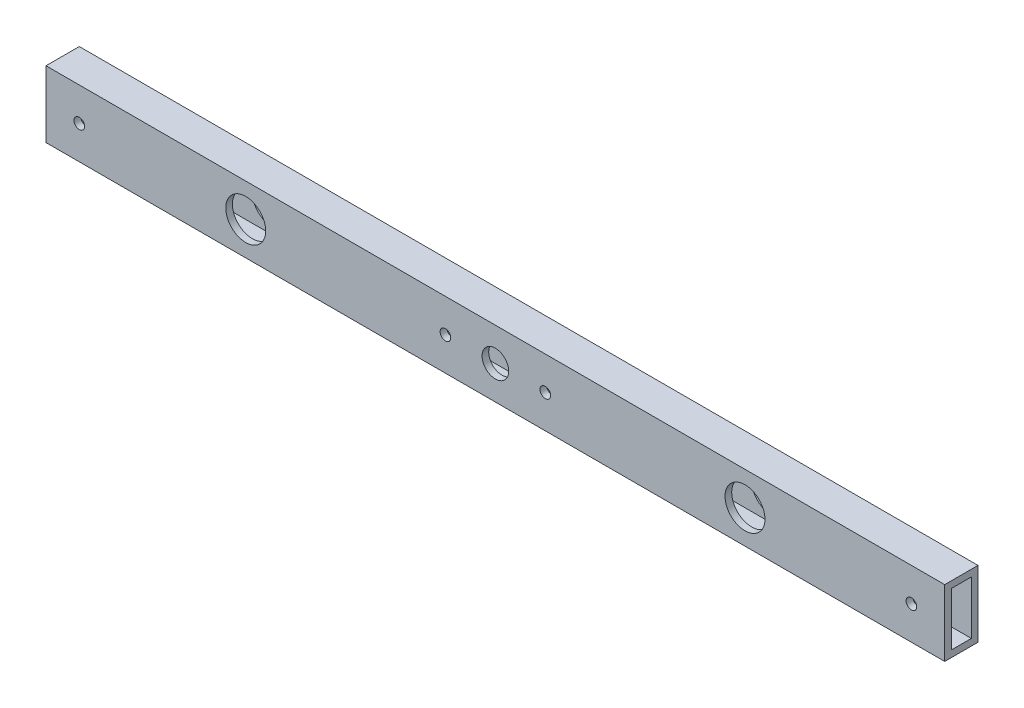
ISO-10303-21;
HEADER;
FILE_DESCRIPTION(('STEP AP214'),'2;1');
FILE_NAME('part.step','',(''),(''),'','','');
FILE_SCHEMA(('AUTOMOTIVE_DESIGN { 1 0 10303 214 1 1 1 1 }'));
ENDSEC;
DATA;
#1=APPLICATION_CONTEXT('core data for automotive mechanical design processes');
#2=APPLICATION_PROTOCOL_DEFINITION('international standard','automotive_design',2000,#1);
#3=PRODUCT_CONTEXT('',#1,'mechanical');
#4=PRODUCT('Part','Part','',(#3));
#5=PRODUCT_RELATED_PRODUCT_CATEGORY('part','',(#4));
#6=PRODUCT_DEFINITION_FORMATION('','',#4);
#7=PRODUCT_DEFINITION_CONTEXT('part definition',#1,'design');
#8=PRODUCT_DEFINITION('design','',#6,#7);
#9=PRODUCT_DEFINITION_SHAPE('','',#8);
#10=(LENGTH_UNIT() NAMED_UNIT(*) SI_UNIT(.MILLI.,.METRE.));
#11=(NAMED_UNIT(*) PLANE_ANGLE_UNIT() SI_UNIT($,.RADIAN.));
#12=(NAMED_UNIT(*) SI_UNIT($,.STERADIAN.) SOLID_ANGLE_UNIT());
#13=UNCERTAINTY_MEASURE_WITH_UNIT(LENGTH_MEASURE(1.E-05),#10,'distance_accuracy_value','');
#14=(GEOMETRIC_REPRESENTATION_CONTEXT(3) GLOBAL_UNCERTAINTY_ASSIGNED_CONTEXT((#13)) GLOBAL_UNIT_ASSIGNED_CONTEXT((#10,
#11,#12)) REPRESENTATION_CONTEXT('',''));
#15=CARTESIAN_POINT('',(0.,0.,0.));
#16=DIRECTION('',(0.,0.,1.));
#17=DIRECTION('',(1.,0.,0.));
#18=AXIS2_PLACEMENT_3D('',#15,#16,#17);
#19=CARTESIAN_POINT('',(270.,-8.,3.));
#20=DIRECTION('',(0.,0.,-1.));
#21=DIRECTION('',(-1.,0.,0.));
#22=AXIS2_PLACEMENT_3D('',#19,#20,#21);
#23=PLANE('',#22);
#24=CARTESIAN_POINT('',(120.,0.,3.));
#25=DIRECTION('',(0.,0.,-1.));
#26=DIRECTION('',(-1.,0.,0.));
#27=AXIS2_PLACEMENT_3D('',#24,#25,#26);
#28=CIRCLE('',#27,1.60000000000001);
#29=CARTESIAN_POINT('',(118.4,0.,3.));
#30=VERTEX_POINT('',#29);
#31=EDGE_CURVE('E263',#30,#30,#28,.T.);
#32=ORIENTED_EDGE('',*,*,#31,.F.);
#33=EDGE_LOOP('',(#32));
#34=FACE_BOUND('',#33,.T.);
#35=CARTESIAN_POINT('',(150.,0.,3.));
#36=DIRECTION('',(0.,0.,-1.));
#37=DIRECTION('',(-1.,0.,0.));
#38=AXIS2_PLACEMENT_3D('',#35,#36,#37);
#39=CIRCLE('',#38,1.59999999999999);
#40=CARTESIAN_POINT('',(148.4,0.,3.));
#41=VERTEX_POINT('',#40);
#42=EDGE_CURVE('E269',#41,#41,#39,.T.);
#43=ORIENTED_EDGE('',*,*,#42,.F.);
#44=EDGE_LOOP('',(#43));
#45=FACE_BOUND('',#44,.T.);
#46=CARTESIAN_POINT('',(135.,0.,3.));
#47=DIRECTION('',(0.,0.,-1.));
#48=DIRECTION('',(-1.,0.,0.));
#49=AXIS2_PLACEMENT_3D('',#46,#47,#48);
#50=CIRCLE('',#49,3.99999999999999);
#51=CARTESIAN_POINT('',(131.,0.,3.));
#52=VERTEX_POINT('',#51);
#53=EDGE_CURVE('E244',#52,#52,#50,.T.);
#54=ORIENTED_EDGE('',*,*,#53,.F.);
#55=EDGE_LOOP('',(#54));
#56=FACE_BOUND('',#55,.T.);
#57=CARTESIAN_POINT('',(60.,0.,3.));
#58=DIRECTION('',(0.,0.,-1.));
#59=DIRECTION('',(-1.,0.,0.));
#60=AXIS2_PLACEMENT_3D('',#57,#58,#59);
#61=CIRCLE('',#60,6.);
#62=CARTESIAN_POINT('',(54.,0.,3.));
#63=VERTEX_POINT('',#62);
#64=EDGE_CURVE('E220',#63,#63,#61,.T.);
#65=ORIENTED_EDGE('',*,*,#64,.F.);
#66=EDGE_LOOP('',(#65));
#67=FACE_BOUND('',#66,.T.);
#68=CARTESIAN_POINT('',(210.,0.,3.));
#69=DIRECTION('',(0.,0.,-1.));
#70=DIRECTION('',(-1.,0.,0.));
#71=AXIS2_PLACEMENT_3D('',#68,#69,#70);
#72=CIRCLE('',#71,6.00000000000002);
#73=CARTESIAN_POINT('',(204.,0.,3.));
#74=VERTEX_POINT('',#73);
#75=EDGE_CURVE('E233',#74,#74,#72,.T.);
#76=ORIENTED_EDGE('',*,*,#75,.F.);
#77=EDGE_LOOP('',(#76));
#78=FACE_BOUND('',#77,.T.);
#79=CARTESIAN_POINT('',(10.,0.,3.));
#80=DIRECTION('',(0.,0.,-1.));
#81=DIRECTION('',(-1.,0.,0.));
#82=AXIS2_PLACEMENT_3D('',#79,#80,#81);
#83=CIRCLE('',#82,1.6);
#84=CARTESIAN_POINT('',(8.40000000000001,0.,3.));
#85=VERTEX_POINT('',#84);
#86=EDGE_CURVE('E155',#85,#85,#83,.T.);
#87=ORIENTED_EDGE('',*,*,#86,.F.);
#88=EDGE_LOOP('',(#87));
#89=FACE_BOUND('',#88,.T.);
#90=CARTESIAN_POINT('',(260.,0.,3.));
#91=DIRECTION('',(0.,0.,-1.));
#92=DIRECTION('',(-1.,0.,0.));
#93=AXIS2_PLACEMENT_3D('',#90,#91,#92);
#94=CIRCLE('',#93,1.59999999999996);
#95=CARTESIAN_POINT('',(258.4,0.,3.));
#96=VERTEX_POINT('',#95);
#97=EDGE_CURVE('E209',#96,#96,#94,.T.);
#98=ORIENTED_EDGE('',*,*,#97,.F.);
#99=EDGE_LOOP('',(#98));
#100=FACE_BOUND('',#99,.T.);
#101=DIRECTION('',(0.,-1.,0.));
#102=VECTOR('',#101,1.);
#103=CARTESIAN_POINT('',(0.,-8.,3.));
#104=LINE('',#103,#102);
#105=CARTESIAN_POINT('',(0.,8.,3.));
#106=VERTEX_POINT('',#105);
#107=CARTESIAN_POINT('',(0.,-8.,3.));
#108=VERTEX_POINT('',#107);
#109=EDGE_CURVE('E161',#106,#108,#104,.T.);
#110=ORIENTED_EDGE('',*,*,#109,.F.);
#111=DIRECTION('',(-1.,0.,0.));
#112=VECTOR('',#111,1.);
#113=CARTESIAN_POINT('',(270.,8.,3.));
#114=LINE('',#113,#112);
#115=CARTESIAN_POINT('',(270.,8.,3.));
#116=VERTEX_POINT('',#115);
#117=EDGE_CURVE('E12',#116,#106,#114,.T.);
#118=ORIENTED_EDGE('',*,*,#117,.F.);
#119=DIRECTION('',(0.,-1.,0.));
#120=VECTOR('',#119,1.);
#121=CARTESIAN_POINT('',(270.,-8.,3.));
#122=LINE('',#121,#120);
#123=CARTESIAN_POINT('',(270.,-8.,3.));
#124=VERTEX_POINT('',#123);
#125=EDGE_CURVE('E142',#116,#124,#122,.T.);
#126=ORIENTED_EDGE('',*,*,#125,.T.);
#127=DIRECTION('',(-1.,0.,0.));
#128=VECTOR('',#127,1.);
#129=CARTESIAN_POINT('',(270.,-8.,3.));
#130=LINE('',#129,#128);
#131=EDGE_CURVE('E73',#124,#108,#130,.T.);
#132=ORIENTED_EDGE('',*,*,#131,.T.);
#133=EDGE_LOOP('',(#110,#118,#126,#132));
#134=FACE_BOUND('',#133,.T.);
#135=ADVANCED_FACE('F54',(#34,#45,#56,#67,#78,#89,#100,#134),#23,.T.);
#136=CARTESIAN_POINT('',(270.,8.,3.));
#137=DIRECTION('',(0.,-1.,0.));
#138=DIRECTION('',(0.,0.,-1.));
#139=AXIS2_PLACEMENT_3D('',#136,#137,#138);
#140=PLANE('',#139);
#141=DIRECTION('',(0.,0.,1.));
#142=VECTOR('',#141,1.);
#143=CARTESIAN_POINT('',(0.,8.,3.));
#144=LINE('',#143,#142);
#145=CARTESIAN_POINT('',(0.,8.,-3.));
#146=VERTEX_POINT('',#145);
#147=EDGE_CURVE('E131',#146,#106,#144,.T.);
#148=ORIENTED_EDGE('',*,*,#147,.F.);
#149=DIRECTION('',(-1.,0.,0.));
#150=VECTOR('',#149,1.);
#151=CARTESIAN_POINT('',(270.,8.,-3.));
#152=LINE('',#151,#150);
#153=CARTESIAN_POINT('',(270.,8.,-3.));
#154=VERTEX_POINT('',#153);
#155=EDGE_CURVE('E64',#154,#146,#152,.T.);
#156=ORIENTED_EDGE('',*,*,#155,.F.);
#157=DIRECTION('',(0.,0.,1.));
#158=VECTOR('',#157,1.);
#159=CARTESIAN_POINT('',(270.,8.,3.));
#160=LINE('',#159,#158);
#161=EDGE_CURVE('E129',#154,#116,#160,.T.);
#162=ORIENTED_EDGE('',*,*,#161,.T.);
#163=ORIENTED_EDGE('',*,*,#117,.T.);
#164=EDGE_LOOP('',(#148,#156,#162,#163));
#165=FACE_BOUND('',#164,.T.);
#166=ADVANCED_FACE('F128',(#165),#140,.T.);
#167=CARTESIAN_POINT('',(270.,-8.,-3.));
#168=DIRECTION('',(0.,0.,1.));
#169=DIRECTION('',(1.,0.,0.));
#170=AXIS2_PLACEMENT_3D('',#167,#168,#169);
#171=PLANE('',#170);
#172=CARTESIAN_POINT('',(120.,0.,-3.));
#173=DIRECTION('',(0.,0.,1.));
#174=DIRECTION('',(1.,0.,0.));
#175=AXIS2_PLACEMENT_3D('',#172,#173,#174);
#176=CIRCLE('',#175,1.60000000000001);
#177=CARTESIAN_POINT('',(121.6,0.,-3.));
#178=VERTEX_POINT('',#177);
#179=EDGE_CURVE('E266',#178,#178,#176,.T.);
#180=ORIENTED_EDGE('',*,*,#179,.F.);
#181=EDGE_LOOP('',(#180));
#182=FACE_BOUND('',#181,.T.);
#183=CARTESIAN_POINT('',(150.,0.,-3.));
#184=DIRECTION('',(0.,0.,1.));
#185=DIRECTION('',(1.,0.,0.));
#186=AXIS2_PLACEMENT_3D('',#183,#184,#185);
#187=CIRCLE('',#186,1.59999999999999);
#188=CARTESIAN_POINT('',(151.6,0.,-3.));
#189=VERTEX_POINT('',#188);
#190=EDGE_CURVE('E272',#189,#189,#187,.T.);
#191=ORIENTED_EDGE('',*,*,#190,.F.);
#192=EDGE_LOOP('',(#191));
#193=FACE_BOUND('',#192,.T.);
#194=CARTESIAN_POINT('',(135.,0.,-3.));
#195=DIRECTION('',(0.,0.,1.));
#196=DIRECTION('',(1.,0.,0.));
#197=AXIS2_PLACEMENT_3D('',#194,#195,#196);
#198=CIRCLE('',#197,3.99999999999999);
#199=CARTESIAN_POINT('',(139.,0.,-3.));
#200=VERTEX_POINT('',#199);
#201=EDGE_CURVE('E254',#200,#200,#198,.T.);
#202=ORIENTED_EDGE('',*,*,#201,.F.);
#203=EDGE_LOOP('',(#202));
#204=FACE_BOUND('',#203,.T.);
#205=CARTESIAN_POINT('',(60.,0.,-3.));
#206=DIRECTION('',(0.,0.,1.));
#207=DIRECTION('',(1.,0.,0.));
#208=AXIS2_PLACEMENT_3D('',#205,#206,#207);
#209=CIRCLE('',#208,6.);
#210=CARTESIAN_POINT('',(66.,0.,-3.));
#211=VERTEX_POINT('',#210);
#212=EDGE_CURVE('E230',#211,#211,#209,.T.);
#213=ORIENTED_EDGE('',*,*,#212,.F.);
#214=EDGE_LOOP('',(#213));
#215=FACE_BOUND('',#214,.T.);
#216=CARTESIAN_POINT('',(210.,0.,-3.));
#217=DIRECTION('',(0.,0.,1.));
#218=DIRECTION('',(1.,0.,0.));
#219=AXIS2_PLACEMENT_3D('',#216,#217,#218);
#220=CIRCLE('',#219,6.00000000000002);
#221=CARTESIAN_POINT('',(216.,0.,-3.));
#222=VERTEX_POINT('',#221);
#223=EDGE_CURVE('E236',#222,#222,#220,.T.);
#224=ORIENTED_EDGE('',*,*,#223,.F.);
#225=EDGE_LOOP('',(#224));
#226=FACE_BOUND('',#225,.T.);
#227=CARTESIAN_POINT('',(10.,0.,-3.));
#228=DIRECTION('',(0.,0.,1.));
#229=DIRECTION('',(1.,0.,0.));
#230=AXIS2_PLACEMENT_3D('',#227,#228,#229);
#231=CIRCLE('',#230,1.6);
#232=CARTESIAN_POINT('',(11.6,0.,-3.));
#233=VERTEX_POINT('',#232);
#234=EDGE_CURVE('E206',#233,#233,#231,.T.);
#235=ORIENTED_EDGE('',*,*,#234,.F.);
#236=EDGE_LOOP('',(#235));
#237=FACE_BOUND('',#236,.T.);
#238=CARTESIAN_POINT('',(260.,0.,-3.));
#239=DIRECTION('',(0.,0.,1.));
#240=DIRECTION('',(1.,0.,0.));
#241=AXIS2_PLACEMENT_3D('',#238,#239,#240);
#242=CIRCLE('',#241,1.59999999999996);
#243=CARTESIAN_POINT('',(261.6,0.,-3.));
#244=VERTEX_POINT('',#243);
#245=EDGE_CURVE('E212',#244,#244,#242,.T.);
#246=ORIENTED_EDGE('',*,*,#245,.F.);
#247=EDGE_LOOP('',(#246));
#248=FACE_BOUND('',#247,.T.);
#249=DIRECTION('',(0.,1.,0.));
#250=VECTOR('',#249,1.);
#251=CARTESIAN_POINT('',(0.,-8.,-3.));
#252=LINE('',#251,#250);
#253=CARTESIAN_POINT('',(0.,-8.,-3.));
#254=VERTEX_POINT('',#253);
#255=EDGE_CURVE('E164',#254,#146,#252,.T.);
#256=ORIENTED_EDGE('',*,*,#255,.F.);
#257=DIRECTION('',(-1.,0.,0.));
#258=VECTOR('',#257,1.);
#259=CARTESIAN_POINT('',(270.,-8.,-3.));
#260=LINE('',#259,#258);
#261=CARTESIAN_POINT('',(270.,-8.,-3.));
#262=VERTEX_POINT('',#261);
#263=EDGE_CURVE('E98',#262,#254,#260,.T.);
#264=ORIENTED_EDGE('',*,*,#263,.F.);
#265=DIRECTION('',(0.,1.,0.));
#266=VECTOR('',#265,1.);
#267=CARTESIAN_POINT('',(270.,-8.,-3.));
#268=LINE('',#267,#266);
#269=EDGE_CURVE('E141',#262,#154,#268,.T.);
#270=ORIENTED_EDGE('',*,*,#269,.T.);
#271=ORIENTED_EDGE('',*,*,#155,.T.);
#272=EDGE_LOOP('',(#256,#264,#270,#271));
#273=FACE_BOUND('',#272,.T.);
#274=ADVANCED_FACE('F144',(#182,#193,#204,#215,#226,#237,#248,#273),#171,.T.);
#275=CARTESIAN_POINT('',(270.,-10.,-5.));
#276=DIRECTION('',(0.,0.,1.));
#277=DIRECTION('',(1.,0.,0.));
#278=AXIS2_PLACEMENT_3D('',#275,#276,#277);
#279=PLANE('',#278);
#280=CARTESIAN_POINT('',(120.,0.,-5.));
#281=DIRECTION('',(0.,0.,1.));
#282=DIRECTION('',(1.,0.,0.));
#283=AXIS2_PLACEMENT_3D('',#280,#281,#282);
#284=CIRCLE('',#283,1.60000000000001);
#285=CARTESIAN_POINT('',(121.6,0.,-5.));
#286=VERTEX_POINT('',#285);
#287=EDGE_CURVE('E275',#286,#286,#284,.T.);
#288=ORIENTED_EDGE('',*,*,#287,.T.);
#289=EDGE_LOOP('',(#288));
#290=FACE_BOUND('',#289,.T.);
#291=CARTESIAN_POINT('',(150.,0.,-5.));
#292=DIRECTION('',(0.,0.,1.));
#293=DIRECTION('',(1.,0.,0.));
#294=AXIS2_PLACEMENT_3D('',#291,#292,#293);
#295=CIRCLE('',#294,1.59999999999999);
#296=CARTESIAN_POINT('',(151.6,0.,-5.));
#297=VERTEX_POINT('',#296);
#298=EDGE_CURVE('E279',#297,#297,#295,.T.);
#299=ORIENTED_EDGE('',*,*,#298,.T.);
#300=EDGE_LOOP('',(#299));
#301=FACE_BOUND('',#300,.T.);
#302=CARTESIAN_POINT('',(135.,0.,-5.));
#303=DIRECTION('',(0.,0.,1.));
#304=DIRECTION('',(1.,0.,0.));
#305=AXIS2_PLACEMENT_3D('',#302,#303,#304);
#306=CIRCLE('',#305,3.99999999999999);
#307=CARTESIAN_POINT('',(139.,0.,-5.));
#308=VERTEX_POINT('',#307);
#309=EDGE_CURVE('E257',#308,#308,#306,.T.);
#310=ORIENTED_EDGE('',*,*,#309,.T.);
#311=EDGE_LOOP('',(#310));
#312=FACE_BOUND('',#311,.T.);
#313=CARTESIAN_POINT('',(60.,0.,-5.));
#314=DIRECTION('',(0.,0.,1.));
#315=DIRECTION('',(1.,0.,0.));
#316=AXIS2_PLACEMENT_3D('',#313,#314,#315);
#317=CIRCLE('',#316,6.);
#318=CARTESIAN_POINT('',(66.,0.,-5.));
#319=VERTEX_POINT('',#318);
#320=EDGE_CURVE('E239',#319,#319,#317,.T.);
#321=ORIENTED_EDGE('',*,*,#320,.T.);
#322=EDGE_LOOP('',(#321));
#323=FACE_BOUND('',#322,.T.);
#324=CARTESIAN_POINT('',(210.,0.,-5.));
#325=DIRECTION('',(0.,0.,1.));
#326=DIRECTION('',(-1.,0.,0.));
#327=AXIS2_PLACEMENT_3D('',#324,#325,#326);
#328=CIRCLE('',#327,6.00000000000002);
#329=CARTESIAN_POINT('',(204.,0.,-5.));
#330=VERTEX_POINT('',#329);
#331=EDGE_CURVE('E243',#330,#330,#328,.T.);
#332=ORIENTED_EDGE('',*,*,#331,.T.);
#333=EDGE_LOOP('',(#332));
#334=FACE_BOUND('',#333,.T.);
#335=CARTESIAN_POINT('',(10.,0.,-5.));
#336=DIRECTION('',(0.,0.,1.));
#337=DIRECTION('',(1.,0.,0.));
#338=AXIS2_PLACEMENT_3D('',#335,#336,#337);
#339=CIRCLE('',#338,1.6);
#340=CARTESIAN_POINT('',(11.6,0.,-5.));
#341=VERTEX_POINT('',#340);
#342=EDGE_CURVE('E215',#341,#341,#339,.T.);
#343=ORIENTED_EDGE('',*,*,#342,.T.);
#344=EDGE_LOOP('',(#343));
#345=FACE_BOUND('',#344,.T.);
#346=CARTESIAN_POINT('',(260.,0.,-5.));
#347=DIRECTION('',(0.,0.,1.));
#348=DIRECTION('',(-1.,0.,0.));
#349=AXIS2_PLACEMENT_3D('',#346,#347,#348);
#350=CIRCLE('',#349,1.59999999999996);
#351=CARTESIAN_POINT('',(258.4,0.,-5.));
#352=VERTEX_POINT('',#351);
#353=EDGE_CURVE('E219',#352,#352,#350,.T.);
#354=ORIENTED_EDGE('',*,*,#353,.T.);
#355=EDGE_LOOP('',(#354));
#356=FACE_BOUND('',#355,.T.);
#357=DIRECTION('',(0.,1.,0.));
#358=VECTOR('',#357,1.);
#359=CARTESIAN_POINT('',(0.,-10.,-5.));
#360=LINE('',#359,#358);
#361=CARTESIAN_POINT('',(0.,-10.,-5.));
#362=VERTEX_POINT('',#361);
#363=CARTESIAN_POINT('',(0.,10.,-5.));
#364=VERTEX_POINT('',#363);
#365=EDGE_CURVE('E151',#362,#364,#360,.T.);
#366=ORIENTED_EDGE('',*,*,#365,.T.);
#367=DIRECTION('',(-1.,0.,0.));
#368=VECTOR('',#367,1.);
#369=CARTESIAN_POINT('',(270.,10.,-5.));
#370=LINE('',#369,#368);
#371=CARTESIAN_POINT('',(270.,10.,-5.));
#372=VERTEX_POINT('',#371);
#373=EDGE_CURVE('E58',#372,#364,#370,.T.);
#374=ORIENTED_EDGE('',*,*,#373,.F.);
#375=DIRECTION('',(0.,1.,0.));
#376=VECTOR('',#375,1.);
#377=CARTESIAN_POINT('',(270.,-10.,-5.));
#378=LINE('',#377,#376);
#379=CARTESIAN_POINT('',(270.,-10.,-5.));
#380=VERTEX_POINT('',#379);
#381=EDGE_CURVE('E169',#380,#372,#378,.T.);
#382=ORIENTED_EDGE('',*,*,#381,.F.);
#383=DIRECTION('',(-1.,0.,0.));
#384=VECTOR('',#383,1.);
#385=CARTESIAN_POINT('',(270.,-10.,-5.));
#386=LINE('',#385,#384);
#387=EDGE_CURVE('E147',#380,#362,#386,.T.);
#388=ORIENTED_EDGE('',*,*,#387,.T.);
#389=EDGE_LOOP('',(#366,#374,#382,#388));
#390=FACE_BOUND('',#389,.T.);
#391=ADVANCED_FACE('F56',(#290,#301,#312,#323,#334,#345,#356,#390),#279,.F.);
#392=CARTESIAN_POINT('',(270.,10.,5.));
#393=DIRECTION('',(0.,-1.,0.));
#394=DIRECTION('',(0.,0.,-1.));
#395=AXIS2_PLACEMENT_3D('',#392,#393,#394);
#396=PLANE('',#395);
#397=DIRECTION('',(0.,0.,1.));
#398=VECTOR('',#397,1.);
#399=CARTESIAN_POINT('',(0.,10.,5.));
#400=LINE('',#399,#398);
#401=CARTESIAN_POINT('',(0.,10.,5.));
#402=VERTEX_POINT('',#401);
#403=EDGE_CURVE('E154',#364,#402,#400,.T.);
#404=ORIENTED_EDGE('',*,*,#403,.T.);
#405=DIRECTION('',(-1.,0.,0.));
#406=VECTOR('',#405,1.);
#407=CARTESIAN_POINT('',(270.,10.,5.));
#408=LINE('',#407,#406);
#409=CARTESIAN_POINT('',(270.,10.,5.));
#410=VERTEX_POINT('',#409);
#411=EDGE_CURVE('E176',#410,#402,#408,.T.);
#412=ORIENTED_EDGE('',*,*,#411,.F.);
#413=DIRECTION('',(0.,0.,1.));
#414=VECTOR('',#413,1.);
#415=CARTESIAN_POINT('',(270.,10.,5.));
#416=LINE('',#415,#414);
#417=EDGE_CURVE('E111',#372,#410,#416,.T.);
#418=ORIENTED_EDGE('',*,*,#417,.F.);
#419=ORIENTED_EDGE('',*,*,#373,.T.);
#420=EDGE_LOOP('',(#404,#412,#418,#419));
#421=FACE_BOUND('',#420,.T.);
#422=ADVANCED_FACE('F182',(#421),#396,.F.);
#423=CARTESIAN_POINT('',(270.,-10.,5.));
#424=DIRECTION('',(0.,0.,-1.));
#425=DIRECTION('',(-1.,0.,0.));
#426=AXIS2_PLACEMENT_3D('',#423,#424,#425);
#427=PLANE('',#426);
#428=CARTESIAN_POINT('',(120.,0.,5.));
#429=DIRECTION('',(0.,0.,1.));
#430=DIRECTION('',(1.,0.,0.));
#431=AXIS2_PLACEMENT_3D('',#428,#429,#430);
#432=CIRCLE('',#431,1.60000000000001);
#433=CARTESIAN_POINT('',(121.6,0.,5.));
#434=VERTEX_POINT('',#433);
#435=EDGE_CURVE('E282',#434,#434,#432,.T.);
#436=ORIENTED_EDGE('',*,*,#435,.F.);
#437=EDGE_LOOP('',(#436));
#438=FACE_BOUND('',#437,.T.);
#439=CARTESIAN_POINT('',(150.,0.,5.));
#440=DIRECTION('',(0.,0.,1.));
#441=DIRECTION('',(1.,0.,0.));
#442=AXIS2_PLACEMENT_3D('',#439,#440,#441);
#443=CIRCLE('',#442,1.59999999999999);
#444=CARTESIAN_POINT('',(151.6,0.,5.));
#445=VERTEX_POINT('',#444);
#446=EDGE_CURVE('E276',#445,#445,#443,.T.);
#447=ORIENTED_EDGE('',*,*,#446,.F.);
#448=EDGE_LOOP('',(#447));
#449=FACE_BOUND('',#448,.T.);
#450=CARTESIAN_POINT('',(135.,0.,5.));
#451=DIRECTION('',(0.,0.,1.));
#452=DIRECTION('',(1.,0.,0.));
#453=AXIS2_PLACEMENT_3D('',#450,#451,#452);
#454=CIRCLE('',#453,3.99999999999999);
#455=CARTESIAN_POINT('',(139.,0.,5.));
#456=VERTEX_POINT('',#455);
#457=EDGE_CURVE('E260',#456,#456,#454,.T.);
#458=ORIENTED_EDGE('',*,*,#457,.F.);
#459=EDGE_LOOP('',(#458));
#460=FACE_BOUND('',#459,.T.);
#461=CARTESIAN_POINT('',(60.,0.,5.));
#462=DIRECTION('',(0.,0.,1.));
#463=DIRECTION('',(1.,0.,0.));
#464=AXIS2_PLACEMENT_3D('',#461,#462,#463);
#465=CIRCLE('',#464,6.);
#466=CARTESIAN_POINT('',(66.,0.,5.));
#467=VERTEX_POINT('',#466);
#468=EDGE_CURVE('E247',#467,#467,#465,.T.);
#469=ORIENTED_EDGE('',*,*,#468,.F.);
#470=EDGE_LOOP('',(#469));
#471=FACE_BOUND('',#470,.T.);
#472=CARTESIAN_POINT('',(210.,0.,5.));
#473=DIRECTION('',(0.,0.,1.));
#474=DIRECTION('',(-1.,0.,0.));
#475=AXIS2_PLACEMENT_3D('',#472,#473,#474);
#476=CIRCLE('',#475,6.00000000000002);
#477=CARTESIAN_POINT('',(204.,0.,5.));
#478=VERTEX_POINT('',#477);
#479=EDGE_CURVE('E240',#478,#478,#476,.T.);
#480=ORIENTED_EDGE('',*,*,#479,.F.);
#481=EDGE_LOOP('',(#480));
#482=FACE_BOUND('',#481,.T.);
#483=CARTESIAN_POINT('',(10.,0.,5.));
#484=DIRECTION('',(0.,0.,1.));
#485=DIRECTION('',(1.,0.,0.));
#486=AXIS2_PLACEMENT_3D('',#483,#484,#485);
#487=CIRCLE('',#486,1.6);
#488=CARTESIAN_POINT('',(11.6,0.,5.));
#489=VERTEX_POINT('',#488);
#490=EDGE_CURVE('E223',#489,#489,#487,.T.);
#491=ORIENTED_EDGE('',*,*,#490,.F.);
#492=EDGE_LOOP('',(#491));
#493=FACE_BOUND('',#492,.T.);
#494=CARTESIAN_POINT('',(260.,0.,5.));
#495=DIRECTION('',(0.,0.,1.));
#496=DIRECTION('',(-1.,0.,0.));
#497=AXIS2_PLACEMENT_3D('',#494,#495,#496);
#498=CIRCLE('',#497,1.59999999999996);
#499=CARTESIAN_POINT('',(258.4,0.,5.));
#500=VERTEX_POINT('',#499);
#501=EDGE_CURVE('E216',#500,#500,#498,.T.);
#502=ORIENTED_EDGE('',*,*,#501,.F.);
#503=EDGE_LOOP('',(#502));
#504=FACE_BOUND('',#503,.T.);
#505=DIRECTION('',(0.,-1.,0.));
#506=VECTOR('',#505,1.);
#507=CARTESIAN_POINT('',(0.,-10.,5.));
#508=LINE('',#507,#506);
#509=CARTESIAN_POINT('',(0.,-10.,5.));
#510=VERTEX_POINT('',#509);
#511=EDGE_CURVE('E157',#402,#510,#508,.T.);
#512=ORIENTED_EDGE('',*,*,#511,.T.);
#513=DIRECTION('',(-1.,0.,0.));
#514=VECTOR('',#513,1.);
#515=CARTESIAN_POINT('',(270.,-10.,5.));
#516=LINE('',#515,#514);
#517=CARTESIAN_POINT('',(270.,-10.,5.));
#518=VERTEX_POINT('',#517);
#519=EDGE_CURVE('E174',#518,#510,#516,.T.);
#520=ORIENTED_EDGE('',*,*,#519,.F.);
#521=DIRECTION('',(0.,-1.,0.));
#522=VECTOR('',#521,1.);
#523=CARTESIAN_POINT('',(270.,-10.,5.));
#524=LINE('',#523,#522);
#525=EDGE_CURVE('E198',#410,#518,#524,.T.);
#526=ORIENTED_EDGE('',*,*,#525,.F.);
#527=ORIENTED_EDGE('',*,*,#411,.T.);
#528=EDGE_LOOP('',(#512,#520,#526,#527));
#529=FACE_BOUND('',#528,.T.);
#530=ADVANCED_FACE('F192',(#438,#449,#460,#471,#482,#493,#504,#529),#427,.F.);
#531=CARTESIAN_POINT('',(270.,-10.,5.));
#532=DIRECTION('',(0.,1.,0.));
#533=DIRECTION('',(0.,0.,1.));
#534=AXIS2_PLACEMENT_3D('',#531,#532,#533);
#535=PLANE('',#534);
#536=DIRECTION('',(0.,0.,-1.));
#537=VECTOR('',#536,1.);
#538=CARTESIAN_POINT('',(0.,-10.,5.));
#539=LINE('',#538,#537);
#540=EDGE_CURVE('E159',#510,#362,#539,.T.);
#541=ORIENTED_EDGE('',*,*,#540,.T.);
#542=ORIENTED_EDGE('',*,*,#387,.F.);
#543=DIRECTION('',(0.,0.,-1.));
#544=VECTOR('',#543,1.);
#545=CARTESIAN_POINT('',(270.,-10.,5.));
#546=LINE('',#545,#544);
#547=EDGE_CURVE('E196',#518,#380,#546,.T.);
#548=ORIENTED_EDGE('',*,*,#547,.F.);
#549=ORIENTED_EDGE('',*,*,#519,.T.);
#550=EDGE_LOOP('',(#541,#542,#548,#549));
#551=FACE_BOUND('',#550,.T.);
#552=ADVANCED_FACE('F195',(#551),#535,.F.);
#553=CARTESIAN_POINT('',(270.,-8.,3.));
#554=DIRECTION('',(0.,1.,0.));
#555=DIRECTION('',(0.,0.,1.));
#556=AXIS2_PLACEMENT_3D('',#553,#554,#555);
#557=PLANE('',#556);
#558=DIRECTION('',(0.,0.,-1.));
#559=VECTOR('',#558,1.);
#560=CARTESIAN_POINT('',(0.,-8.,3.));
#561=LINE('',#560,#559);
#562=EDGE_CURVE('E166',#108,#254,#561,.T.);
#563=ORIENTED_EDGE('',*,*,#562,.F.);
#564=ORIENTED_EDGE('',*,*,#131,.F.);
#565=DIRECTION('',(0.,0.,-1.));
#566=VECTOR('',#565,1.);
#567=CARTESIAN_POINT('',(270.,-8.,3.));
#568=LINE('',#567,#566);
#569=EDGE_CURVE('E145',#124,#262,#568,.T.);
#570=ORIENTED_EDGE('',*,*,#569,.T.);
#571=ORIENTED_EDGE('',*,*,#263,.T.);
#572=EDGE_LOOP('',(#563,#564,#570,#571));
#573=FACE_BOUND('',#572,.T.);
#574=ADVANCED_FACE('F317',(#573),#557,.T.);
#575=CARTESIAN_POINT('',(270.,0.,0.));
#576=DIRECTION('',(-1.,0.,0.));
#577=DIRECTION('',(0.,0.,1.));
#578=AXIS2_PLACEMENT_3D('',#575,#576,#577);
#579=PLANE('',#578);
#580=ORIENTED_EDGE('',*,*,#381,.T.);
#581=ORIENTED_EDGE('',*,*,#417,.T.);
#582=ORIENTED_EDGE('',*,*,#525,.T.);
#583=ORIENTED_EDGE('',*,*,#547,.T.);
#584=EDGE_LOOP('',(#580,#581,#582,#583));
#585=FACE_BOUND('',#584,.T.);
#586=ORIENTED_EDGE('',*,*,#125,.F.);
#587=ORIENTED_EDGE('',*,*,#161,.F.);
#588=ORIENTED_EDGE('',*,*,#269,.F.);
#589=ORIENTED_EDGE('',*,*,#569,.F.);
#590=EDGE_LOOP('',(#586,#587,#588,#589));
#591=FACE_BOUND('',#590,.T.);
#592=ADVANCED_FACE('F139',(#585,#591),#579,.F.);
#593=CARTESIAN_POINT('',(0.,0.,0.));
#594=DIRECTION('',(-1.,0.,0.));
#595=DIRECTION('',(0.,0.,1.));
#596=AXIS2_PLACEMENT_3D('',#593,#594,#595);
#597=PLANE('',#596);
#598=ORIENTED_EDGE('',*,*,#365,.F.);
#599=ORIENTED_EDGE('',*,*,#540,.F.);
#600=ORIENTED_EDGE('',*,*,#511,.F.);
#601=ORIENTED_EDGE('',*,*,#403,.F.);
#602=EDGE_LOOP('',(#598,#599,#600,#601));
#603=FACE_BOUND('',#602,.T.);
#604=ORIENTED_EDGE('',*,*,#109,.T.);
#605=ORIENTED_EDGE('',*,*,#562,.T.);
#606=ORIENTED_EDGE('',*,*,#255,.T.);
#607=ORIENTED_EDGE('',*,*,#147,.T.);
#608=EDGE_LOOP('',(#604,#605,#606,#607));
#609=FACE_BOUND('',#608,.T.);
#610=ADVANCED_FACE('F189',(#603,#609),#597,.T.);
#611=CARTESIAN_POINT('',(260.,0.,-5.));
#612=DIRECTION('',(0.,0.,1.));
#613=DIRECTION('',(1.,0.,0.));
#614=AXIS2_PLACEMENT_3D('',#611,#612,#613);
#615=CYLINDRICAL_SURFACE('',#614,1.59999999999996);
#616=ORIENTED_EDGE('',*,*,#97,.T.);
#617=EDGE_LOOP('',(#616));
#618=FACE_BOUND('',#617,.T.);
#619=ORIENTED_EDGE('',*,*,#501,.T.);
#620=EDGE_LOOP('',(#619));
#621=FACE_BOUND('',#620,.T.);
#622=ADVANCED_FACE('F337',(#618,#621),#615,.F.);
#623=CARTESIAN_POINT('',(10.,0.,-5.));
#624=DIRECTION('',(0.,0.,1.));
#625=DIRECTION('',(1.,0.,0.));
#626=AXIS2_PLACEMENT_3D('',#623,#624,#625);
#627=CYLINDRICAL_SURFACE('',#626,1.6);
#628=ORIENTED_EDGE('',*,*,#86,.T.);
#629=EDGE_LOOP('',(#628));
#630=FACE_BOUND('',#629,.T.);
#631=ORIENTED_EDGE('',*,*,#490,.T.);
#632=EDGE_LOOP('',(#631));
#633=FACE_BOUND('',#632,.T.);
#634=ADVANCED_FACE('F344',(#630,#633),#627,.F.);
#635=ORIENTED_EDGE('',*,*,#245,.T.);
#636=EDGE_LOOP('',(#635));
#637=FACE_BOUND('',#636,.T.);
#638=ORIENTED_EDGE('',*,*,#353,.F.);
#639=EDGE_LOOP('',(#638));
#640=FACE_BOUND('',#639,.T.);
#641=ADVANCED_FACE('F340',(#637,#640),#615,.F.);
#642=ORIENTED_EDGE('',*,*,#234,.T.);
#643=EDGE_LOOP('',(#642));
#644=FACE_BOUND('',#643,.T.);
#645=ORIENTED_EDGE('',*,*,#342,.F.);
#646=EDGE_LOOP('',(#645));
#647=FACE_BOUND('',#646,.T.);
#648=ADVANCED_FACE('F343',(#644,#647),#627,.F.);
#649=CARTESIAN_POINT('',(210.,0.,-5.));
#650=DIRECTION('',(0.,0.,1.));
#651=DIRECTION('',(1.,0.,0.));
#652=AXIS2_PLACEMENT_3D('',#649,#650,#651);
#653=CYLINDRICAL_SURFACE('',#652,6.00000000000002);
#654=ORIENTED_EDGE('',*,*,#75,.T.);
#655=EDGE_LOOP('',(#654));
#656=FACE_BOUND('',#655,.T.);
#657=ORIENTED_EDGE('',*,*,#479,.T.);
#658=EDGE_LOOP('',(#657));
#659=FACE_BOUND('',#658,.T.);
#660=ADVANCED_FACE('F348',(#656,#659),#653,.F.);
#661=CARTESIAN_POINT('',(60.,0.,-5.));
#662=DIRECTION('',(0.,0.,1.));
#663=DIRECTION('',(1.,0.,0.));
#664=AXIS2_PLACEMENT_3D('',#661,#662,#663);
#665=CYLINDRICAL_SURFACE('',#664,6.);
#666=ORIENTED_EDGE('',*,*,#64,.T.);
#667=EDGE_LOOP('',(#666));
#668=FACE_BOUND('',#667,.T.);
#669=ORIENTED_EDGE('',*,*,#468,.T.);
#670=EDGE_LOOP('',(#669));
#671=FACE_BOUND('',#670,.T.);
#672=ADVANCED_FACE('F354',(#668,#671),#665,.F.);
#673=ORIENTED_EDGE('',*,*,#223,.T.);
#674=EDGE_LOOP('',(#673));
#675=FACE_BOUND('',#674,.T.);
#676=ORIENTED_EDGE('',*,*,#331,.F.);
#677=EDGE_LOOP('',(#676));
#678=FACE_BOUND('',#677,.T.);
#679=ADVANCED_FACE('F350',(#675,#678),#653,.F.);
#680=ORIENTED_EDGE('',*,*,#212,.T.);
#681=EDGE_LOOP('',(#680));
#682=FACE_BOUND('',#681,.T.);
#683=ORIENTED_EDGE('',*,*,#320,.F.);
#684=EDGE_LOOP('',(#683));
#685=FACE_BOUND('',#684,.T.);
#686=ADVANCED_FACE('F353',(#682,#685),#665,.F.);
#687=CARTESIAN_POINT('',(135.,0.,-13.));
#688=DIRECTION('',(0.,0.,1.));
#689=DIRECTION('',(1.,0.,0.));
#690=AXIS2_PLACEMENT_3D('',#687,#688,#689);
#691=CYLINDRICAL_SURFACE('',#690,3.99999999999999);
#692=ORIENTED_EDGE('',*,*,#53,.T.);
#693=EDGE_LOOP('',(#692));
#694=FACE_BOUND('',#693,.T.);
#695=ORIENTED_EDGE('',*,*,#457,.T.);
#696=EDGE_LOOP('',(#695));
#697=FACE_BOUND('',#696,.T.);
#698=ADVANCED_FACE('F358',(#694,#697),#691,.F.);
#699=ORIENTED_EDGE('',*,*,#201,.T.);
#700=EDGE_LOOP('',(#699));
#701=FACE_BOUND('',#700,.T.);
#702=ORIENTED_EDGE('',*,*,#309,.F.);
#703=EDGE_LOOP('',(#702));
#704=FACE_BOUND('',#703,.T.);
#705=ADVANCED_FACE('F361',(#701,#704),#691,.F.);
#706=CARTESIAN_POINT('',(150.,0.,-5.));
#707=DIRECTION('',(0.,0.,1.));
#708=DIRECTION('',(1.,0.,0.));
#709=AXIS2_PLACEMENT_3D('',#706,#707,#708);
#710=CYLINDRICAL_SURFACE('',#709,1.59999999999999);
#711=ORIENTED_EDGE('',*,*,#42,.T.);
#712=EDGE_LOOP('',(#711));
#713=FACE_BOUND('',#712,.T.);
#714=ORIENTED_EDGE('',*,*,#446,.T.);
#715=EDGE_LOOP('',(#714));
#716=FACE_BOUND('',#715,.T.);
#717=ADVANCED_FACE('F301',(#713,#716),#710,.F.);
#718=CARTESIAN_POINT('',(120.,0.,-5.));
#719=DIRECTION('',(0.,0.,1.));
#720=DIRECTION('',(1.,0.,0.));
#721=AXIS2_PLACEMENT_3D('',#718,#719,#720);
#722=CYLINDRICAL_SURFACE('',#721,1.60000000000001);
#723=ORIENTED_EDGE('',*,*,#31,.T.);
#724=EDGE_LOOP('',(#723));
#725=FACE_BOUND('',#724,.T.);
#726=ORIENTED_EDGE('',*,*,#435,.T.);
#727=EDGE_LOOP('',(#726));
#728=FACE_BOUND('',#727,.T.);
#729=ADVANCED_FACE('F295',(#725,#728),#722,.F.);
#730=ORIENTED_EDGE('',*,*,#190,.T.);
#731=EDGE_LOOP('',(#730));
#732=FACE_BOUND('',#731,.T.);
#733=ORIENTED_EDGE('',*,*,#298,.F.);
#734=EDGE_LOOP('',(#733));
#735=FACE_BOUND('',#734,.T.);
#736=ADVANCED_FACE('F292',(#732,#735),#710,.F.);
#737=ORIENTED_EDGE('',*,*,#179,.T.);
#738=EDGE_LOOP('',(#737));
#739=FACE_BOUND('',#738,.T.);
#740=ORIENTED_EDGE('',*,*,#287,.F.);
#741=EDGE_LOOP('',(#740));
#742=FACE_BOUND('',#741,.T.);
#743=ADVANCED_FACE('F290',(#739,#742),#722,.F.);
#744=CLOSED_SHELL('',(#135,#166,#274,#391,#422,#530,#552,#574,#592,#610,#622,#634,#641,#648,
#660,#672,#679,#686,#698,#705,#717,#729,#736,#743));
#745=MANIFOLD_SOLID_BREP('B2',#744);
#746=ADVANCED_BREP_SHAPE_REPRESENTATION('',(#18,#745),#14);
#747=SHAPE_DEFINITION_REPRESENTATION(#9,#746);
ENDSEC;
END-ISO-10303-21;
